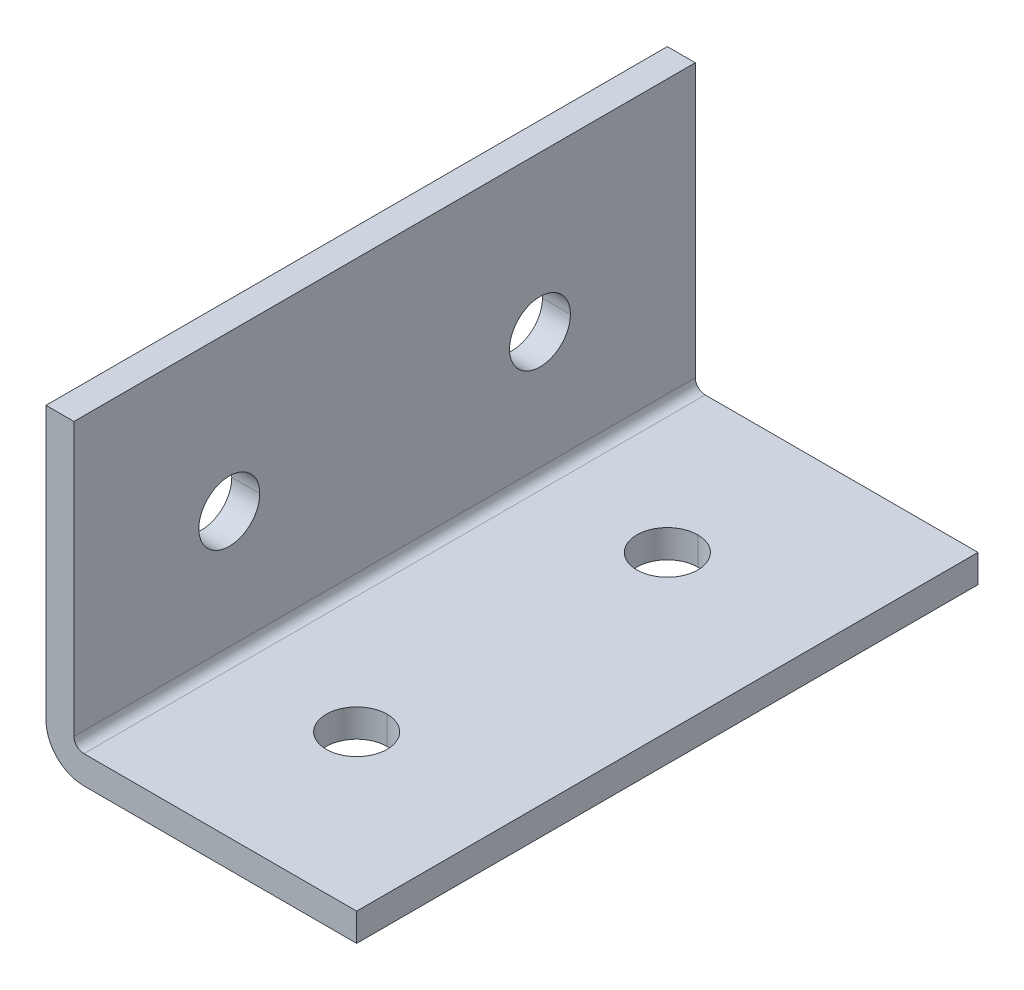
ISO-10303-21;
HEADER;
FILE_DESCRIPTION(('STEP AP214'),'2;1');
FILE_NAME('part.step','',(''),(''),'','','');
FILE_SCHEMA(('AUTOMOTIVE_DESIGN { 1 0 10303 214 1 1 1 1 }'));
ENDSEC;
DATA;
#1=APPLICATION_CONTEXT('core data for automotive mechanical design processes');
#2=APPLICATION_PROTOCOL_DEFINITION('international standard','automotive_design',2000,#1);
#3=PRODUCT_CONTEXT('',#1,'mechanical');
#4=PRODUCT('Part','Part','',(#3));
#5=PRODUCT_RELATED_PRODUCT_CATEGORY('part','',(#4));
#6=PRODUCT_DEFINITION_FORMATION('','',#4);
#7=PRODUCT_DEFINITION_CONTEXT('part definition',#1,'design');
#8=PRODUCT_DEFINITION('design','',#6,#7);
#9=PRODUCT_DEFINITION_SHAPE('','',#8);
#10=(LENGTH_UNIT() NAMED_UNIT(*) SI_UNIT(.MILLI.,.METRE.));
#11=(NAMED_UNIT(*) PLANE_ANGLE_UNIT() SI_UNIT($,.RADIAN.));
#12=(NAMED_UNIT(*) SI_UNIT($,.STERADIAN.) SOLID_ANGLE_UNIT());
#13=UNCERTAINTY_MEASURE_WITH_UNIT(LENGTH_MEASURE(1.E-05),#10,'distance_accuracy_value','');
#14=(GEOMETRIC_REPRESENTATION_CONTEXT(3) GLOBAL_UNCERTAINTY_ASSIGNED_CONTEXT((#13)) GLOBAL_UNIT_ASSIGNED_CONTEXT((#10,
#11,#12)) REPRESENTATION_CONTEXT('',''));
#15=CARTESIAN_POINT('',(0.,0.,0.));
#16=DIRECTION('',(0.,0.,1.));
#17=DIRECTION('',(1.,0.,0.));
#18=AXIS2_PLACEMENT_3D('',#15,#16,#17);
#19=CARTESIAN_POINT('',(12.7,0.,0.));
#20=DIRECTION('',(0.,1.,0.));
#21=DIRECTION('',(0.,0.,1.));
#22=AXIS2_PLACEMENT_3D('',#19,#20,#21);
#23=CYLINDRICAL_SURFACE('',#22,2.4892);
#24=DIRECTION('',(0.,1.,0.));
#25=VECTOR('',#24,1.);
#26=CARTESIAN_POINT('',(12.7,0.,-2.4892));
#27=LINE('',#26,#25);
#28=CARTESIAN_POINT('',(12.7,0.,-2.4892));
#29=VERTEX_POINT('',#28);
#30=CARTESIAN_POINT('',(12.7,2.286,-2.4892));
#31=VERTEX_POINT('',#30);
#32=EDGE_CURVE('E20',#29,#31,#27,.T.);
#33=ORIENTED_EDGE('',*,*,#32,.F.);
#34=CARTESIAN_POINT('',(12.7,0.,0.));
#35=DIRECTION('',(0.,1.,0.));
#36=DIRECTION('',(0.,0.,1.));
#37=AXIS2_PLACEMENT_3D('',#34,#35,#36);
#38=CIRCLE('',#37,2.4892);
#39=CARTESIAN_POINT('',(12.7,0.,2.4892));
#40=VERTEX_POINT('',#39);
#41=EDGE_CURVE('E269',#40,#29,#38,.T.);
#42=ORIENTED_EDGE('',*,*,#41,.F.);
#43=DIRECTION('',(0.,1.,0.));
#44=VECTOR('',#43,1.);
#45=CARTESIAN_POINT('',(12.7,0.,2.4892));
#46=LINE('',#45,#44);
#47=CARTESIAN_POINT('',(12.7,2.286,2.4892));
#48=VERTEX_POINT('',#47);
#49=EDGE_CURVE('E251',#40,#48,#46,.T.);
#50=ORIENTED_EDGE('',*,*,#49,.T.);
#51=CARTESIAN_POINT('',(12.7,2.286,0.));
#52=DIRECTION('',(0.,1.,0.));
#53=DIRECTION('',(0.,0.,1.));
#54=AXIS2_PLACEMENT_3D('',#51,#52,#53);
#55=CIRCLE('',#54,2.4892);
#56=EDGE_CURVE('E27',#48,#31,#55,.T.);
#57=ORIENTED_EDGE('',*,*,#56,.T.);
#58=EDGE_LOOP('',(#33,#42,#50,#57));
#59=FACE_BOUND('',#58,.T.);
#60=ADVANCED_FACE('F16',(#59),#23,.F.);
#61=CARTESIAN_POINT('',(12.7,0.,25.4));
#62=DIRECTION('',(0.,1.,0.));
#63=DIRECTION('',(0.,0.,1.));
#64=AXIS2_PLACEMENT_3D('',#61,#62,#63);
#65=CYLINDRICAL_SURFACE('',#64,2.4892);
#66=DIRECTION('',(0.,1.,0.));
#67=VECTOR('',#66,1.);
#68=CARTESIAN_POINT('',(12.7,0.,22.9108));
#69=LINE('',#68,#67);
#70=CARTESIAN_POINT('',(12.7,0.,22.9108));
#71=VERTEX_POINT('',#70);
#72=CARTESIAN_POINT('',(12.7,2.286,22.9108));
#73=VERTEX_POINT('',#72);
#74=EDGE_CURVE('E219',#71,#73,#69,.T.);
#75=ORIENTED_EDGE('',*,*,#74,.F.);
#76=CARTESIAN_POINT('',(12.7,0.,25.4));
#77=DIRECTION('',(0.,1.,0.));
#78=DIRECTION('',(0.,0.,1.));
#79=AXIS2_PLACEMENT_3D('',#76,#77,#78);
#80=CIRCLE('',#79,2.4892);
#81=CARTESIAN_POINT('',(12.7,0.,27.8892));
#82=VERTEX_POINT('',#81);
#83=EDGE_CURVE('E326',#82,#71,#80,.T.);
#84=ORIENTED_EDGE('',*,*,#83,.F.);
#85=DIRECTION('',(0.,1.,0.));
#86=VECTOR('',#85,1.);
#87=CARTESIAN_POINT('',(12.7,0.,27.8892));
#88=LINE('',#87,#86);
#89=CARTESIAN_POINT('',(12.7,2.286,27.8892));
#90=VERTEX_POINT('',#89);
#91=EDGE_CURVE('E200',#82,#90,#88,.T.);
#92=ORIENTED_EDGE('',*,*,#91,.T.);
#93=CARTESIAN_POINT('',(12.7,2.286,25.4));
#94=DIRECTION('',(0.,1.,0.));
#95=DIRECTION('',(0.,0.,1.));
#96=AXIS2_PLACEMENT_3D('',#93,#94,#95);
#97=CIRCLE('',#96,2.4892);
#98=EDGE_CURVE('E11',#90,#73,#97,.T.);
#99=ORIENTED_EDGE('',*,*,#98,.T.);
#100=EDGE_LOOP('',(#75,#84,#92,#99));
#101=FACE_BOUND('',#100,.T.);
#102=ADVANCED_FACE('F364',(#101),#65,.F.);
#103=CARTESIAN_POINT('',(0.,12.7,25.4));
#104=DIRECTION('',(1.,0.,0.));
#105=DIRECTION('',(0.,0.,-1.));
#106=AXIS2_PLACEMENT_3D('',#103,#104,#105);
#107=CYLINDRICAL_SURFACE('',#106,2.4892);
#108=DIRECTION('',(1.,0.,0.));
#109=VECTOR('',#108,1.);
#110=CARTESIAN_POINT('',(0.,12.7,27.8892));
#111=LINE('',#110,#109);
#112=CARTESIAN_POINT('',(0.,12.7,27.8892));
#113=VERTEX_POINT('',#112);
#114=CARTESIAN_POINT('',(2.286,12.7,27.8892));
#115=VERTEX_POINT('',#114);
#116=EDGE_CURVE('E175',#113,#115,#111,.T.);
#117=ORIENTED_EDGE('',*,*,#116,.F.);
#118=CARTESIAN_POINT('',(0.,12.7,25.4));
#119=DIRECTION('',(1.,0.,0.));
#120=DIRECTION('',(0.,0.,-1.));
#121=AXIS2_PLACEMENT_3D('',#118,#119,#120);
#122=CIRCLE('',#121,2.4892);
#123=CARTESIAN_POINT('',(0.,12.7,22.9108));
#124=VERTEX_POINT('',#123);
#125=EDGE_CURVE('E215',#124,#113,#122,.T.);
#126=ORIENTED_EDGE('',*,*,#125,.F.);
#127=DIRECTION('',(1.,0.,0.));
#128=VECTOR('',#127,1.);
#129=CARTESIAN_POINT('',(0.,12.7,22.9108));
#130=LINE('',#129,#128);
#131=CARTESIAN_POINT('',(2.286,12.7,22.9108));
#132=VERTEX_POINT('',#131);
#133=EDGE_CURVE('E178',#124,#132,#130,.T.);
#134=ORIENTED_EDGE('',*,*,#133,.T.);
#135=CARTESIAN_POINT('',(2.286,12.7,25.4));
#136=DIRECTION('',(1.,0.,0.));
#137=DIRECTION('',(0.,0.,-1.));
#138=AXIS2_PLACEMENT_3D('',#135,#136,#137);
#139=CIRCLE('',#138,2.4892);
#140=EDGE_CURVE('E171',#132,#115,#139,.T.);
#141=ORIENTED_EDGE('',*,*,#140,.T.);
#142=EDGE_LOOP('',(#117,#126,#134,#141));
#143=FACE_BOUND('',#142,.T.);
#144=ADVANCED_FACE('F173',(#143),#107,.F.);
#145=CARTESIAN_POINT('',(0.,12.7,0.));
#146=DIRECTION('',(1.,0.,0.));
#147=DIRECTION('',(0.,0.,-1.));
#148=AXIS2_PLACEMENT_3D('',#145,#146,#147);
#149=CYLINDRICAL_SURFACE('',#148,2.4892);
#150=DIRECTION('',(1.,0.,0.));
#151=VECTOR('',#150,1.);
#152=CARTESIAN_POINT('',(0.,12.7,2.4892));
#153=LINE('',#152,#151);
#154=CARTESIAN_POINT('',(0.,12.7,2.4892));
#155=VERTEX_POINT('',#154);
#156=CARTESIAN_POINT('',(2.286,12.7,2.4892));
#157=VERTEX_POINT('',#156);
#158=EDGE_CURVE('E206',#155,#157,#153,.T.);
#159=ORIENTED_EDGE('',*,*,#158,.F.);
#160=CARTESIAN_POINT('',(0.,12.7,0.));
#161=DIRECTION('',(1.,0.,0.));
#162=DIRECTION('',(0.,0.,-1.));
#163=AXIS2_PLACEMENT_3D('',#160,#161,#162);
#164=CIRCLE('',#163,2.4892);
#165=CARTESIAN_POINT('',(0.,12.7,-2.4892));
#166=VERTEX_POINT('',#165);
#167=EDGE_CURVE('E120',#166,#155,#164,.T.);
#168=ORIENTED_EDGE('',*,*,#167,.F.);
#169=DIRECTION('',(1.,0.,0.));
#170=VECTOR('',#169,1.);
#171=CARTESIAN_POINT('',(0.,12.7,-2.4892));
#172=LINE('',#171,#170);
#173=CARTESIAN_POINT('',(2.286,12.7,-2.4892));
#174=VERTEX_POINT('',#173);
#175=EDGE_CURVE('E228',#166,#174,#172,.T.);
#176=ORIENTED_EDGE('',*,*,#175,.T.);
#177=CARTESIAN_POINT('',(2.286,12.7,0.));
#178=DIRECTION('',(1.,0.,0.));
#179=DIRECTION('',(0.,0.,-1.));
#180=AXIS2_PLACEMENT_3D('',#177,#178,#179);
#181=CIRCLE('',#180,2.4892);
#182=EDGE_CURVE('E182',#174,#157,#181,.T.);
#183=ORIENTED_EDGE('',*,*,#182,.T.);
#184=EDGE_LOOP('',(#159,#168,#176,#183));
#185=FACE_BOUND('',#184,.T.);
#186=ADVANCED_FACE('F621',(#185),#149,.F.);
#187=CARTESIAN_POINT('',(0.,-1.2E-05,-12.7));
#188=DIRECTION('',(0.,0.,1.));
#189=DIRECTION('',(1.,0.,0.));
#190=AXIS2_PLACEMENT_3D('',#187,#188,#189);
#191=PLANE('',#190);
#192=CARTESIAN_POINT('',(3.0988,3.0988,-12.7));
#193=DIRECTION('',(0.,0.,-1.));
#194=DIRECTION('',(1.,0.,0.));
#195=AXIS2_PLACEMENT_3D('',#192,#193,#194);
#196=CIRCLE('',#195,3.0988);
#197=CARTESIAN_POINT('',(3.0988,0.,-12.7));
#198=VERTEX_POINT('',#197);
#199=CARTESIAN_POINT('',(0.,3.0988,-12.7));
#200=VERTEX_POINT('',#199);
#201=EDGE_CURVE('E258',#198,#200,#196,.T.);
#202=ORIENTED_EDGE('',*,*,#201,.T.);
#203=DIRECTION('',(0.,1.,0.));
#204=VECTOR('',#203,1.);
#205=CARTESIAN_POINT('',(0.,-1.2E-05,-12.7));
#206=LINE('',#205,#204);
#207=CARTESIAN_POINT('',(0.,25.4,-12.7));
#208=VERTEX_POINT('',#207);
#209=EDGE_CURVE('E243',#200,#208,#206,.T.);
#210=ORIENTED_EDGE('',*,*,#209,.T.);
#211=DIRECTION('',(1.,0.,0.));
#212=VECTOR('',#211,1.);
#213=CARTESIAN_POINT('',(0.,25.4,-12.7));
#214=LINE('',#213,#212);
#215=CARTESIAN_POINT('',(2.286,25.4,-12.7));
#216=VERTEX_POINT('',#215);
#217=EDGE_CURVE('E252',#208,#216,#214,.T.);
#218=ORIENTED_EDGE('',*,*,#217,.T.);
#219=DIRECTION('',(0.,1.,0.));
#220=VECTOR('',#219,1.);
#221=CARTESIAN_POINT('',(2.286,0.,-12.7));
#222=LINE('',#221,#220);
#223=CARTESIAN_POINT('',(2.286,3.0988,-12.7));
#224=VERTEX_POINT('',#223);
#225=EDGE_CURVE('E290',#224,#216,#222,.T.);
#226=ORIENTED_EDGE('',*,*,#225,.F.);
#227=CARTESIAN_POINT('',(3.0988,3.0988,-12.7));
#228=DIRECTION('',(0.,0.,-1.));
#229=DIRECTION('',(1.,0.,0.));
#230=AXIS2_PLACEMENT_3D('',#227,#228,#229);
#231=CIRCLE('',#230,0.8128);
#232=CARTESIAN_POINT('',(3.0988,2.286,-12.7));
#233=VERTEX_POINT('',#232);
#234=EDGE_CURVE('E316',#233,#224,#231,.T.);
#235=ORIENTED_EDGE('',*,*,#234,.F.);
#236=DIRECTION('',(-1.,0.,0.));
#237=VECTOR('',#236,1.);
#238=CARTESIAN_POINT('',(0.,2.286,-12.7));
#239=LINE('',#238,#237);
#240=CARTESIAN_POINT('',(25.4,2.286,-12.7));
#241=VERTEX_POINT('',#240);
#242=EDGE_CURVE('E298',#241,#233,#239,.T.);
#243=ORIENTED_EDGE('',*,*,#242,.F.);
#244=DIRECTION('',(0.,1.,0.));
#245=VECTOR('',#244,1.);
#246=CARTESIAN_POINT('',(25.4,-1.2E-05,-12.7));
#247=LINE('',#246,#245);
#248=CARTESIAN_POINT('',(25.4,0.,-12.7));
#249=VERTEX_POINT('',#248);
#250=EDGE_CURVE('E275',#249,#241,#247,.T.);
#251=ORIENTED_EDGE('',*,*,#250,.F.);
#252=DIRECTION('',(-1.,0.,0.));
#253=VECTOR('',#252,1.);
#254=CARTESIAN_POINT('',(0.,0.,-12.7));
#255=LINE('',#254,#253);
#256=EDGE_CURVE('E214',#249,#198,#255,.T.);
#257=ORIENTED_EDGE('',*,*,#256,.T.);
#258=EDGE_LOOP('',(#202,#210,#218,#226,#235,#243,#251,#257));
#259=FACE_BOUND('',#258,.T.);
#260=ADVANCED_FACE('F381',(#259),#191,.F.);
#261=CARTESIAN_POINT('',(0.,-1.2E-05,38.1));
#262=DIRECTION('',(0.,0.,1.));
#263=DIRECTION('',(1.,0.,0.));
#264=AXIS2_PLACEMENT_3D('',#261,#262,#263);
#265=PLANE('',#264);
#266=DIRECTION('',(-1.,0.,0.));
#267=VECTOR('',#266,1.);
#268=CARTESIAN_POINT('',(0.,0.,38.1));
#269=LINE('',#268,#267);
#270=CARTESIAN_POINT('',(25.4,0.,38.1));
#271=VERTEX_POINT('',#270);
#272=CARTESIAN_POINT('',(3.0988,0.,38.1));
#273=VERTEX_POINT('',#272);
#274=EDGE_CURVE('E237',#271,#273,#269,.T.);
#275=ORIENTED_EDGE('',*,*,#274,.F.);
#276=DIRECTION('',(0.,1.,0.));
#277=VECTOR('',#276,1.);
#278=CARTESIAN_POINT('',(25.4,-1.2E-05,38.1));
#279=LINE('',#278,#277);
#280=CARTESIAN_POINT('',(25.4,2.286,38.1));
#281=VERTEX_POINT('',#280);
#282=EDGE_CURVE('E274',#271,#281,#279,.T.);
#283=ORIENTED_EDGE('',*,*,#282,.T.);
#284=DIRECTION('',(-1.,0.,0.));
#285=VECTOR('',#284,1.);
#286=CARTESIAN_POINT('',(0.,2.286,38.1));
#287=LINE('',#286,#285);
#288=CARTESIAN_POINT('',(3.0988,2.286,38.1));
#289=VERTEX_POINT('',#288);
#290=EDGE_CURVE('E42',#281,#289,#287,.T.);
#291=ORIENTED_EDGE('',*,*,#290,.T.);
#292=CARTESIAN_POINT('',(3.0988,3.0988,38.1));
#293=DIRECTION('',(0.,0.,-1.));
#294=DIRECTION('',(1.,0.,0.));
#295=AXIS2_PLACEMENT_3D('',#292,#293,#294);
#296=CIRCLE('',#295,0.8128);
#297=CARTESIAN_POINT('',(2.286,3.0988,38.1));
#298=VERTEX_POINT('',#297);
#299=EDGE_CURVE('E296',#289,#298,#296,.T.);
#300=ORIENTED_EDGE('',*,*,#299,.T.);
#301=DIRECTION('',(0.,1.,0.));
#302=VECTOR('',#301,1.);
#303=CARTESIAN_POINT('',(2.286,0.,38.1));
#304=LINE('',#303,#302);
#305=CARTESIAN_POINT('',(2.286,25.4,38.1));
#306=VERTEX_POINT('',#305);
#307=EDGE_CURVE('E183',#298,#306,#304,.T.);
#308=ORIENTED_EDGE('',*,*,#307,.T.);
#309=DIRECTION('',(1.,0.,0.));
#310=VECTOR('',#309,1.);
#311=CARTESIAN_POINT('',(0.,25.4,38.1));
#312=LINE('',#311,#310);
#313=CARTESIAN_POINT('',(0.,25.4,38.1));
#314=VERTEX_POINT('',#313);
#315=EDGE_CURVE('E256',#314,#306,#312,.T.);
#316=ORIENTED_EDGE('',*,*,#315,.F.);
#317=DIRECTION('',(0.,1.,0.));
#318=VECTOR('',#317,1.);
#319=CARTESIAN_POINT('',(0.,-1.2E-05,38.1));
#320=LINE('',#319,#318);
#321=CARTESIAN_POINT('',(0.,3.0988,38.1));
#322=VERTEX_POINT('',#321);
#323=EDGE_CURVE('E242',#322,#314,#320,.T.);
#324=ORIENTED_EDGE('',*,*,#323,.F.);
#325=CARTESIAN_POINT('',(3.0988,3.0988,38.1));
#326=DIRECTION('',(0.,0.,-1.));
#327=DIRECTION('',(1.,0.,0.));
#328=AXIS2_PLACEMENT_3D('',#325,#326,#327);
#329=CIRCLE('',#328,3.0988);
#330=EDGE_CURVE('E322',#273,#322,#329,.T.);
#331=ORIENTED_EDGE('',*,*,#330,.F.);
#332=EDGE_LOOP('',(#275,#283,#291,#300,#308,#316,#324,#331));
#333=FACE_BOUND('',#332,.T.);
#334=ADVANCED_FACE('F18',(#333),#265,.T.);
#335=CARTESIAN_POINT('',(0.,2.286,-749.3));
#336=DIRECTION('',(0.,-1.,0.));
#337=DIRECTION('',(0.,0.,-1.));
#338=AXIS2_PLACEMENT_3D('',#335,#336,#337);
#339=PLANE('',#338);
#340=ORIENTED_EDGE('',*,*,#98,.F.);
#341=CARTESIAN_POINT('',(12.7,2.286,25.4));
#342=DIRECTION('',(0.,1.,0.));
#343=DIRECTION('',(0.,0.,1.));
#344=AXIS2_PLACEMENT_3D('',#341,#342,#343);
#345=CIRCLE('',#344,2.4892);
#346=EDGE_CURVE('E222',#73,#90,#345,.T.);
#347=ORIENTED_EDGE('',*,*,#346,.F.);
#348=EDGE_LOOP('',(#340,#347));
#349=FACE_BOUND('',#348,.T.);
#350=ORIENTED_EDGE('',*,*,#56,.F.);
#351=CARTESIAN_POINT('',(12.7,2.286,0.));
#352=DIRECTION('',(0.,1.,0.));
#353=DIRECTION('',(0.,0.,1.));
#354=AXIS2_PLACEMENT_3D('',#351,#352,#353);
#355=CIRCLE('',#354,2.4892);
#356=EDGE_CURVE('E247',#31,#48,#355,.T.);
#357=ORIENTED_EDGE('',*,*,#356,.F.);
#358=EDGE_LOOP('',(#350,#357));
#359=FACE_BOUND('',#358,.T.);
#360=DIRECTION('',(0.,0.,1.));
#361=VECTOR('',#360,1.);
#362=CARTESIAN_POINT('',(25.4,2.286,-749.3));
#363=LINE('',#362,#361);
#364=EDGE_CURVE('E270',#241,#281,#363,.T.);
#365=ORIENTED_EDGE('',*,*,#364,.F.);
#366=ORIENTED_EDGE('',*,*,#242,.T.);
#367=DIRECTION('',(0.,0.,-1.));
#368=VECTOR('',#367,1.);
#369=CARTESIAN_POINT('',(3.0988,2.286,-749.3));
#370=LINE('',#369,#368);
#371=EDGE_CURVE('E204',#289,#233,#370,.T.);
#372=ORIENTED_EDGE('',*,*,#371,.F.);
#373=ORIENTED_EDGE('',*,*,#290,.F.);
#374=EDGE_LOOP('',(#365,#366,#372,#373));
#375=FACE_BOUND('',#374,.T.);
#376=ADVANCED_FACE('F370',(#349,#359,#375),#339,.F.);
#377=CARTESIAN_POINT('',(25.4,2.286,-749.3));
#378=DIRECTION('',(-1.,0.,0.));
#379=DIRECTION('',(0.,0.,1.));
#380=AXIS2_PLACEMENT_3D('',#377,#378,#379);
#381=PLANE('',#380);
#382=DIRECTION('',(0.,0.,1.));
#383=VECTOR('',#382,1.);
#384=CARTESIAN_POINT('',(25.4,0.,-749.3));
#385=LINE('',#384,#383);
#386=EDGE_CURVE('E233',#249,#271,#385,.T.);
#387=ORIENTED_EDGE('',*,*,#386,.F.);
#388=ORIENTED_EDGE('',*,*,#250,.T.);
#389=ORIENTED_EDGE('',*,*,#364,.T.);
#390=ORIENTED_EDGE('',*,*,#282,.F.);
#391=EDGE_LOOP('',(#387,#388,#389,#390));
#392=FACE_BOUND('',#391,.T.);
#393=ADVANCED_FACE('F373',(#392),#381,.F.);
#394=CARTESIAN_POINT('',(3.0988,3.0988,-749.3));
#395=DIRECTION('',(0.,0.,1.));
#396=DIRECTION('',(1.,0.,0.));
#397=AXIS2_PLACEMENT_3D('',#394,#395,#396);
#398=CYLINDRICAL_SURFACE('',#397,0.8128);
#399=ORIENTED_EDGE('',*,*,#371,.T.);
#400=ORIENTED_EDGE('',*,*,#234,.T.);
#401=DIRECTION('',(0.,0.,-1.));
#402=VECTOR('',#401,1.);
#403=CARTESIAN_POINT('',(2.286,3.0988,-749.3));
#404=LINE('',#403,#402);
#405=EDGE_CURVE('E325',#298,#224,#404,.T.);
#406=ORIENTED_EDGE('',*,*,#405,.F.);
#407=ORIENTED_EDGE('',*,*,#299,.F.);
#408=EDGE_LOOP('',(#399,#400,#406,#407));
#409=FACE_BOUND('',#408,.T.);
#410=ADVANCED_FACE('F538',(#409),#398,.F.);
#411=CARTESIAN_POINT('',(0.,0.,-749.3));
#412=DIRECTION('',(0.,-1.,0.));
#413=DIRECTION('',(0.,0.,-1.));
#414=AXIS2_PLACEMENT_3D('',#411,#412,#413);
#415=PLANE('',#414);
#416=ORIENTED_EDGE('',*,*,#83,.T.);
#417=CARTESIAN_POINT('',(12.7,0.,25.4));
#418=DIRECTION('',(0.,1.,0.));
#419=DIRECTION('',(0.,0.,1.));
#420=AXIS2_PLACEMENT_3D('',#417,#418,#419);
#421=CIRCLE('',#420,2.4892);
#422=EDGE_CURVE('E223',#71,#82,#421,.T.);
#423=ORIENTED_EDGE('',*,*,#422,.T.);
#424=EDGE_LOOP('',(#416,#423));
#425=FACE_BOUND('',#424,.T.);
#426=ORIENTED_EDGE('',*,*,#41,.T.);
#427=CARTESIAN_POINT('',(12.7,0.,0.));
#428=DIRECTION('',(0.,1.,0.));
#429=DIRECTION('',(0.,0.,1.));
#430=AXIS2_PLACEMENT_3D('',#427,#428,#429);
#431=CIRCLE('',#430,2.4892);
#432=EDGE_CURVE('E229',#29,#40,#431,.T.);
#433=ORIENTED_EDGE('',*,*,#432,.T.);
#434=EDGE_LOOP('',(#426,#433));
#435=FACE_BOUND('',#434,.T.);
#436=ORIENTED_EDGE('',*,*,#256,.F.);
#437=ORIENTED_EDGE('',*,*,#386,.T.);
#438=ORIENTED_EDGE('',*,*,#274,.T.);
#439=DIRECTION('',(0.,0.,-1.));
#440=VECTOR('',#439,1.);
#441=CARTESIAN_POINT('',(3.0988,0.,-749.3));
#442=LINE('',#441,#440);
#443=EDGE_CURVE('E261',#273,#198,#442,.T.);
#444=ORIENTED_EDGE('',*,*,#443,.T.);
#445=EDGE_LOOP('',(#436,#437,#438,#444));
#446=FACE_BOUND('',#445,.T.);
#447=ADVANCED_FACE('F356',(#425,#435,#446),#415,.T.);
#448=CARTESIAN_POINT('',(2.286,0.,-749.3));
#449=DIRECTION('',(-1.,0.,0.));
#450=DIRECTION('',(0.,0.,1.));
#451=AXIS2_PLACEMENT_3D('',#448,#449,#450);
#452=PLANE('',#451);
#453=ORIENTED_EDGE('',*,*,#182,.F.);
#454=CARTESIAN_POINT('',(2.286,12.7,0.));
#455=DIRECTION('',(1.,0.,0.));
#456=DIRECTION('',(0.,0.,-1.));
#457=AXIS2_PLACEMENT_3D('',#454,#455,#456);
#458=CIRCLE('',#457,2.4892);
#459=EDGE_CURVE('E210',#157,#174,#458,.T.);
#460=ORIENTED_EDGE('',*,*,#459,.F.);
#461=EDGE_LOOP('',(#453,#460));
#462=FACE_BOUND('',#461,.T.);
#463=ORIENTED_EDGE('',*,*,#140,.F.);
#464=CARTESIAN_POINT('',(2.286,12.7,25.4));
#465=DIRECTION('',(1.,0.,0.));
#466=DIRECTION('',(0.,0.,-1.));
#467=AXIS2_PLACEMENT_3D('',#464,#465,#466);
#468=CIRCLE('',#467,2.4892);
#469=EDGE_CURVE('E185',#115,#132,#468,.T.);
#470=ORIENTED_EDGE('',*,*,#469,.F.);
#471=EDGE_LOOP('',(#463,#470));
#472=FACE_BOUND('',#471,.T.);
#473=ORIENTED_EDGE('',*,*,#405,.T.);
#474=ORIENTED_EDGE('',*,*,#225,.T.);
#475=DIRECTION('',(0.,0.,-1.));
#476=VECTOR('',#475,1.);
#477=CARTESIAN_POINT('',(2.286,25.4,-749.3));
#478=LINE('',#477,#476);
#479=EDGE_CURVE('E257',#306,#216,#478,.T.);
#480=ORIENTED_EDGE('',*,*,#479,.F.);
#481=ORIENTED_EDGE('',*,*,#307,.F.);
#482=EDGE_LOOP('',(#473,#474,#480,#481));
#483=FACE_BOUND('',#482,.T.);
#484=ADVANCED_FACE('F186',(#462,#472,#483),#452,.F.);
#485=CARTESIAN_POINT('',(3.0988,3.0988,-749.3));
#486=DIRECTION('',(0.,0.,1.));
#487=DIRECTION('',(1.,0.,0.));
#488=AXIS2_PLACEMENT_3D('',#485,#486,#487);
#489=CYLINDRICAL_SURFACE('',#488,3.0988);
#490=ORIENTED_EDGE('',*,*,#201,.F.);
#491=ORIENTED_EDGE('',*,*,#443,.F.);
#492=ORIENTED_EDGE('',*,*,#330,.T.);
#493=DIRECTION('',(0.,0.,-1.));
#494=VECTOR('',#493,1.);
#495=CARTESIAN_POINT('',(0.,3.0988,-749.3));
#496=LINE('',#495,#494);
#497=EDGE_CURVE('E238',#322,#200,#496,.T.);
#498=ORIENTED_EDGE('',*,*,#497,.T.);
#499=EDGE_LOOP('',(#490,#491,#492,#498));
#500=FACE_BOUND('',#499,.T.);
#501=ADVANCED_FACE('F559',(#500),#489,.T.);
#502=CARTESIAN_POINT('',(0.,25.4,-749.3));
#503=DIRECTION('',(0.,-1.,0.));
#504=DIRECTION('',(0.,0.,-1.));
#505=AXIS2_PLACEMENT_3D('',#502,#503,#504);
#506=PLANE('',#505);
#507=ORIENTED_EDGE('',*,*,#479,.T.);
#508=ORIENTED_EDGE('',*,*,#217,.F.);
#509=DIRECTION('',(0.,0.,-1.));
#510=VECTOR('',#509,1.);
#511=CARTESIAN_POINT('',(0.,25.4,-749.3));
#512=LINE('',#511,#510);
#513=EDGE_CURVE('E218',#314,#208,#512,.T.);
#514=ORIENTED_EDGE('',*,*,#513,.F.);
#515=ORIENTED_EDGE('',*,*,#315,.T.);
#516=EDGE_LOOP('',(#507,#508,#514,#515));
#517=FACE_BOUND('',#516,.T.);
#518=ADVANCED_FACE('F524',(#517),#506,.F.);
#519=CARTESIAN_POINT('',(0.,0.,-749.3));
#520=DIRECTION('',(-1.,0.,0.));
#521=DIRECTION('',(0.,0.,1.));
#522=AXIS2_PLACEMENT_3D('',#519,#520,#521);
#523=PLANE('',#522);
#524=ORIENTED_EDGE('',*,*,#167,.T.);
#525=CARTESIAN_POINT('',(0.,12.7,0.));
#526=DIRECTION('',(1.,0.,0.));
#527=DIRECTION('',(0.,0.,-1.));
#528=AXIS2_PLACEMENT_3D('',#525,#526,#527);
#529=CIRCLE('',#528,2.4892);
#530=EDGE_CURVE('E211',#155,#166,#529,.T.);
#531=ORIENTED_EDGE('',*,*,#530,.T.);
#532=EDGE_LOOP('',(#524,#531));
#533=FACE_BOUND('',#532,.T.);
#534=ORIENTED_EDGE('',*,*,#125,.T.);
#535=CARTESIAN_POINT('',(0.,12.7,25.4));
#536=DIRECTION('',(1.,0.,0.));
#537=DIRECTION('',(0.,0.,-1.));
#538=AXIS2_PLACEMENT_3D('',#535,#536,#537);
#539=CIRCLE('',#538,2.4892);
#540=EDGE_CURVE('E193',#113,#124,#539,.T.);
#541=ORIENTED_EDGE('',*,*,#540,.T.);
#542=EDGE_LOOP('',(#534,#541));
#543=FACE_BOUND('',#542,.T.);
#544=ORIENTED_EDGE('',*,*,#209,.F.);
#545=ORIENTED_EDGE('',*,*,#497,.F.);
#546=ORIENTED_EDGE('',*,*,#323,.T.);
#547=ORIENTED_EDGE('',*,*,#513,.T.);
#548=EDGE_LOOP('',(#544,#545,#546,#547));
#549=FACE_BOUND('',#548,.T.);
#550=ADVANCED_FACE('F519',(#533,#543,#549),#523,.T.);
#551=CARTESIAN_POINT('',(0.,12.7,0.));
#552=DIRECTION('',(1.,0.,0.));
#553=DIRECTION('',(0.,0.,-1.));
#554=AXIS2_PLACEMENT_3D('',#551,#552,#553);
#555=CYLINDRICAL_SURFACE('',#554,2.4892);
#556=ORIENTED_EDGE('',*,*,#530,.F.);
#557=ORIENTED_EDGE('',*,*,#158,.T.);
#558=ORIENTED_EDGE('',*,*,#459,.T.);
#559=ORIENTED_EDGE('',*,*,#175,.F.);
#560=EDGE_LOOP('',(#556,#557,#558,#559));
#561=FACE_BOUND('',#560,.T.);
#562=ADVANCED_FACE('F523',(#561),#555,.F.);
#563=CARTESIAN_POINT('',(0.,12.7,25.4));
#564=DIRECTION('',(1.,0.,0.));
#565=DIRECTION('',(0.,0.,-1.));
#566=AXIS2_PLACEMENT_3D('',#563,#564,#565);
#567=CYLINDRICAL_SURFACE('',#566,2.4892);
#568=ORIENTED_EDGE('',*,*,#540,.F.);
#569=ORIENTED_EDGE('',*,*,#116,.T.);
#570=ORIENTED_EDGE('',*,*,#469,.T.);
#571=ORIENTED_EDGE('',*,*,#133,.F.);
#572=EDGE_LOOP('',(#568,#569,#570,#571));
#573=FACE_BOUND('',#572,.T.);
#574=ADVANCED_FACE('F191',(#573),#567,.F.);
#575=CARTESIAN_POINT('',(12.7,0.,25.4));
#576=DIRECTION('',(0.,1.,0.));
#577=DIRECTION('',(0.,0.,1.));
#578=AXIS2_PLACEMENT_3D('',#575,#576,#577);
#579=CYLINDRICAL_SURFACE('',#578,2.4892);
#580=ORIENTED_EDGE('',*,*,#422,.F.);
#581=ORIENTED_EDGE('',*,*,#74,.T.);
#582=ORIENTED_EDGE('',*,*,#346,.T.);
#583=ORIENTED_EDGE('',*,*,#91,.F.);
#584=EDGE_LOOP('',(#580,#581,#582,#583));
#585=FACE_BOUND('',#584,.T.);
#586=ADVANCED_FACE('F361',(#585),#579,.F.);
#587=CARTESIAN_POINT('',(12.7,0.,0.));
#588=DIRECTION('',(0.,1.,0.));
#589=DIRECTION('',(0.,0.,1.));
#590=AXIS2_PLACEMENT_3D('',#587,#588,#589);
#591=CYLINDRICAL_SURFACE('',#590,2.4892);
#592=ORIENTED_EDGE('',*,*,#432,.F.);
#593=ORIENTED_EDGE('',*,*,#32,.T.);
#594=ORIENTED_EDGE('',*,*,#356,.T.);
#595=ORIENTED_EDGE('',*,*,#49,.F.);
#596=EDGE_LOOP('',(#592,#593,#594,#595));
#597=FACE_BOUND('',#596,.T.);
#598=ADVANCED_FACE('F554',(#597),#591,.F.);
#599=CLOSED_SHELL('',(#60,#102,#144,#186,#260,#334,#376,#393,#410,#447,#484,#501,#518,#550,#562,
#574,#586,#598));
#600=MANIFOLD_SOLID_BREP('B1',#599);
#601=ADVANCED_BREP_SHAPE_REPRESENTATION('',(#18,#600),#14);
#602=SHAPE_DEFINITION_REPRESENTATION(#9,#601);
ENDSEC;
END-ISO-10303-21;
